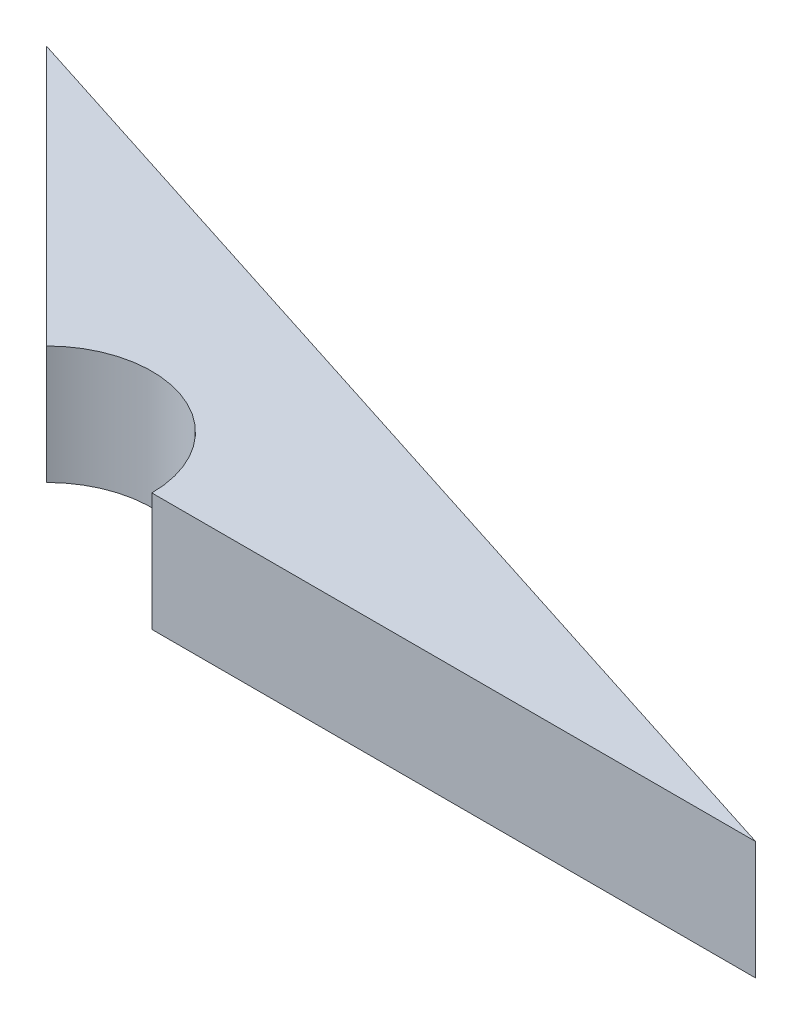
ISO-10303-21;
HEADER;
FILE_DESCRIPTION(('STEP AP214'),'2;1');
FILE_NAME('part.step','',(''),(''),'','','');
FILE_SCHEMA(('AUTOMOTIVE_DESIGN { 1 0 10303 214 1 1 1 1 }'));
ENDSEC;
DATA;
#1=APPLICATION_CONTEXT('core data for automotive mechanical design processes');
#2=APPLICATION_PROTOCOL_DEFINITION('international standard','automotive_design',2000,#1);
#3=PRODUCT_CONTEXT('',#1,'mechanical');
#4=PRODUCT('Part','Part','',(#3));
#5=PRODUCT_RELATED_PRODUCT_CATEGORY('part','',(#4));
#6=PRODUCT_DEFINITION_FORMATION('','',#4);
#7=PRODUCT_DEFINITION_CONTEXT('part definition',#1,'design');
#8=PRODUCT_DEFINITION('design','',#6,#7);
#9=PRODUCT_DEFINITION_SHAPE('','',#8);
#10=(LENGTH_UNIT() NAMED_UNIT(*) SI_UNIT(.MILLI.,.METRE.));
#11=(NAMED_UNIT(*) PLANE_ANGLE_UNIT() SI_UNIT($,.RADIAN.));
#12=(NAMED_UNIT(*) SI_UNIT($,.STERADIAN.) SOLID_ANGLE_UNIT());
#13=UNCERTAINTY_MEASURE_WITH_UNIT(LENGTH_MEASURE(1.E-05),#10,'distance_accuracy_value','');
#14=(GEOMETRIC_REPRESENTATION_CONTEXT(3) GLOBAL_UNCERTAINTY_ASSIGNED_CONTEXT((#13)) GLOBAL_UNIT_ASSIGNED_CONTEXT((#10,
#11,#12)) REPRESENTATION_CONTEXT('',''));
#15=CARTESIAN_POINT('',(0.,0.,0.));
#16=DIRECTION('',(0.,0.,1.));
#17=DIRECTION('',(1.,0.,0.));
#18=AXIS2_PLACEMENT_3D('',#15,#16,#17);
#19=CARTESIAN_POINT('',(-7.32298903590968,5.,0.368016893815827));
#20=DIRECTION('',(-0.30510159287432,0.,0.952319808691152));
#21=DIRECTION('',(0.952319808691152,0.,0.30510159287432));
#22=AXIS2_PLACEMENT_3D('',#19,#20,#21);
#23=PLANE('',#22);
#24=DIRECTION('',(-0.952319808691152,0.,-0.30510159287432));
#25=VECTOR('',#24,1.);
#26=CARTESIAN_POINT('',(-7.32298903590968,0.,0.368016893815827));
#27=LINE('',#26,#25);
#28=CARTESIAN_POINT('',(-7.32298903590968,0.,0.368016893815827));
#29=VERTEX_POINT('',#28);
#30=CARTESIAN_POINT('',(-51.4651246596387,0.,-13.7741187299132));
#31=VERTEX_POINT('',#30);
#32=EDGE_CURVE('E96',#29,#31,#27,.T.);
#33=ORIENTED_EDGE('',*,*,#32,.T.);
#34=DIRECTION('',(0.,-1.,0.));
#35=VECTOR('',#34,1.);
#36=CARTESIAN_POINT('',(-51.4651246596387,5.,-13.7741187299132));
#37=LINE('',#36,#35);
#38=CARTESIAN_POINT('',(-51.4651246596387,5.,-13.7741187299132));
#39=VERTEX_POINT('',#38);
#40=EDGE_CURVE('E11',#39,#31,#37,.T.);
#41=ORIENTED_EDGE('',*,*,#40,.F.);
#42=DIRECTION('',(-0.952319808691152,0.,-0.30510159287432));
#43=VECTOR('',#42,1.);
#44=CARTESIAN_POINT('',(-7.32298903590968,5.,0.368016893815827));
#45=LINE('',#44,#43);
#46=CARTESIAN_POINT('',(-7.32298903590968,5.,0.368016893815827));
#47=VERTEX_POINT('',#46);
#48=EDGE_CURVE('E84',#47,#39,#45,.T.);
#49=ORIENTED_EDGE('',*,*,#48,.F.);
#50=DIRECTION('',(0.,-1.,0.));
#51=VECTOR('',#50,1.);
#52=CARTESIAN_POINT('',(-7.32298903590968,5.,0.368016893815827));
#53=LINE('',#52,#51);
#54=EDGE_CURVE('E92',#47,#29,#53,.T.);
#55=ORIENTED_EDGE('',*,*,#54,.T.);
#56=EDGE_LOOP('',(#33,#41,#49,#55));
#57=FACE_BOUND('',#56,.T.);
#58=ADVANCED_FACE('F33',(#57),#23,.F.);
#59=CARTESIAN_POINT('',(-51.4651246596387,5.,-13.7741187299132));
#60=DIRECTION('',(0.707106781186547,0.,-0.707106781186548));
#61=DIRECTION('',(-0.707106781186548,0.,-0.707106781186547));
#62=AXIS2_PLACEMENT_3D('',#59,#60,#61);
#63=PLANE('',#62);
#64=DIRECTION('',(0.707106781186548,0.,0.707106781186547));
#65=VECTOR('',#64,1.);
#66=CARTESIAN_POINT('',(-51.4651246596387,0.,-13.7741187299132));
#67=LINE('',#66,#65);
#68=CARTESIAN_POINT('',(-40.4769106964079,0.,-2.78590476668239));
#69=VERTEX_POINT('',#68);
#70=EDGE_CURVE('E88',#31,#69,#67,.T.);
#71=ORIENTED_EDGE('',*,*,#70,.T.);
#72=DIRECTION('',(0.,-1.,0.));
#73=VECTOR('',#72,1.);
#74=CARTESIAN_POINT('',(-40.4769106964079,5.,-2.78590476668239));
#75=LINE('',#74,#73);
#76=CARTESIAN_POINT('',(-40.4769106964079,5.,-2.78590476668239));
#77=VERTEX_POINT('',#76);
#78=EDGE_CURVE('E41',#77,#69,#75,.T.);
#79=ORIENTED_EDGE('',*,*,#78,.F.);
#80=DIRECTION('',(0.707106781186548,0.,0.707106781186547));
#81=VECTOR('',#80,1.);
#82=CARTESIAN_POINT('',(-51.4651246596387,5.,-13.7741187299132));
#83=LINE('',#82,#81);
#84=EDGE_CURVE('E79',#39,#77,#83,.T.);
#85=ORIENTED_EDGE('',*,*,#84,.F.);
#86=ORIENTED_EDGE('',*,*,#40,.T.);
#87=EDGE_LOOP('',(#71,#79,#85,#86));
#88=FACE_BOUND('',#87,.T.);
#89=ADVANCED_FACE('F87',(#88),#63,.F.);
#90=CARTESIAN_POINT('',(-37.3229890359097,5.,0.368016893815831));
#91=DIRECTION('',(0.,-1.,0.));
#92=DIRECTION('',(0.,0.,-1.));
#93=AXIS2_PLACEMENT_3D('',#90,#91,#92);
#94=CYLINDRICAL_SURFACE('',#93,4.46031878693885);
#95=CARTESIAN_POINT('',(-37.3229890359097,0.,0.368016893815831));
#96=DIRECTION('',(0.,-1.,0.));
#97=DIRECTION('',(0.,0.,1.));
#98=AXIS2_PLACEMENT_3D('',#95,#96,#97);
#99=CIRCLE('',#98,4.46031878693885);
#100=CARTESIAN_POINT('',(-32.8626702489708,0.,0.36801689381583));
#101=VERTEX_POINT('',#100);
#102=EDGE_CURVE('E66',#69,#101,#99,.T.);
#103=ORIENTED_EDGE('',*,*,#102,.T.);
#104=DIRECTION('',(0.,-1.,0.));
#105=VECTOR('',#104,1.);
#106=CARTESIAN_POINT('',(-32.8626702489708,5.,0.36801689381583));
#107=LINE('',#106,#105);
#108=CARTESIAN_POINT('',(-32.8626702489708,5.,0.36801689381583));
#109=VERTEX_POINT('',#108);
#110=EDGE_CURVE('E89',#109,#101,#107,.T.);
#111=ORIENTED_EDGE('',*,*,#110,.F.);
#112=CARTESIAN_POINT('',(-37.3229890359097,5.,0.368016893815831));
#113=DIRECTION('',(0.,-1.,0.));
#114=DIRECTION('',(0.,0.,1.));
#115=AXIS2_PLACEMENT_3D('',#112,#113,#114);
#116=CIRCLE('',#115,4.46031878693885);
#117=EDGE_CURVE('E82',#77,#109,#116,.T.);
#118=ORIENTED_EDGE('',*,*,#117,.F.);
#119=ORIENTED_EDGE('',*,*,#78,.T.);
#120=EDGE_LOOP('',(#103,#111,#118,#119));
#121=FACE_BOUND('',#120,.T.);
#122=ADVANCED_FACE('F90',(#121),#94,.F.);
#123=CARTESIAN_POINT('',(-7.32298903590968,5.,0.368016893815827));
#124=DIRECTION('',(0.,0.,-1.));
#125=DIRECTION('',(-1.,0.,0.));
#126=AXIS2_PLACEMENT_3D('',#123,#124,#125);
#127=PLANE('',#126);
#128=DIRECTION('',(1.,0.,0.));
#129=VECTOR('',#128,1.);
#130=CARTESIAN_POINT('',(-7.32298903590968,0.,0.368016893815827));
#131=LINE('',#130,#129);
#132=EDGE_CURVE('E72',#101,#29,#131,.T.);
#133=ORIENTED_EDGE('',*,*,#132,.T.);
#134=ORIENTED_EDGE('',*,*,#54,.F.);
#135=DIRECTION('',(1.,0.,0.));
#136=VECTOR('',#135,1.);
#137=CARTESIAN_POINT('',(-7.32298903590968,5.,0.368016893815827));
#138=LINE('',#137,#136);
#139=EDGE_CURVE('E49',#109,#47,#138,.T.);
#140=ORIENTED_EDGE('',*,*,#139,.F.);
#141=ORIENTED_EDGE('',*,*,#110,.T.);
#142=EDGE_LOOP('',(#133,#134,#140,#141));
#143=FACE_BOUND('',#142,.T.);
#144=ADVANCED_FACE('F103',(#143),#127,.F.);
#145=CARTESIAN_POINT('',(-37.3229890359097,5.,0.368016893815831));
#146=DIRECTION('',(0.,1.,0.));
#147=DIRECTION('',(0.,0.,1.));
#148=AXIS2_PLACEMENT_3D('',#145,#146,#147);
#149=PLANE('',#148);
#150=ORIENTED_EDGE('',*,*,#48,.T.);
#151=ORIENTED_EDGE('',*,*,#84,.T.);
#152=ORIENTED_EDGE('',*,*,#117,.T.);
#153=ORIENTED_EDGE('',*,*,#139,.T.);
#154=EDGE_LOOP('',(#150,#151,#152,#153));
#155=FACE_BOUND('',#154,.T.);
#156=ADVANCED_FACE('F80',(#155),#149,.T.);
#157=CARTESIAN_POINT('',(-37.3229890359097,0.,0.368016893815831));
#158=DIRECTION('',(0.,1.,0.));
#159=DIRECTION('',(0.,0.,1.));
#160=AXIS2_PLACEMENT_3D('',#157,#158,#159);
#161=PLANE('',#160);
#162=ORIENTED_EDGE('',*,*,#32,.F.);
#163=ORIENTED_EDGE('',*,*,#132,.F.);
#164=ORIENTED_EDGE('',*,*,#102,.F.);
#165=ORIENTED_EDGE('',*,*,#70,.F.);
#166=EDGE_LOOP('',(#162,#163,#164,#165));
#167=FACE_BOUND('',#166,.T.);
#168=ADVANCED_FACE('F106',(#167),#161,.F.);
#169=CLOSED_SHELL('',(#58,#89,#122,#144,#156,#168));
#170=MANIFOLD_SOLID_BREP('B2',#169);
#171=ADVANCED_BREP_SHAPE_REPRESENTATION('',(#18,#170),#14);
#172=SHAPE_DEFINITION_REPRESENTATION(#9,#171);
ENDSEC;
END-ISO-10303-21;
